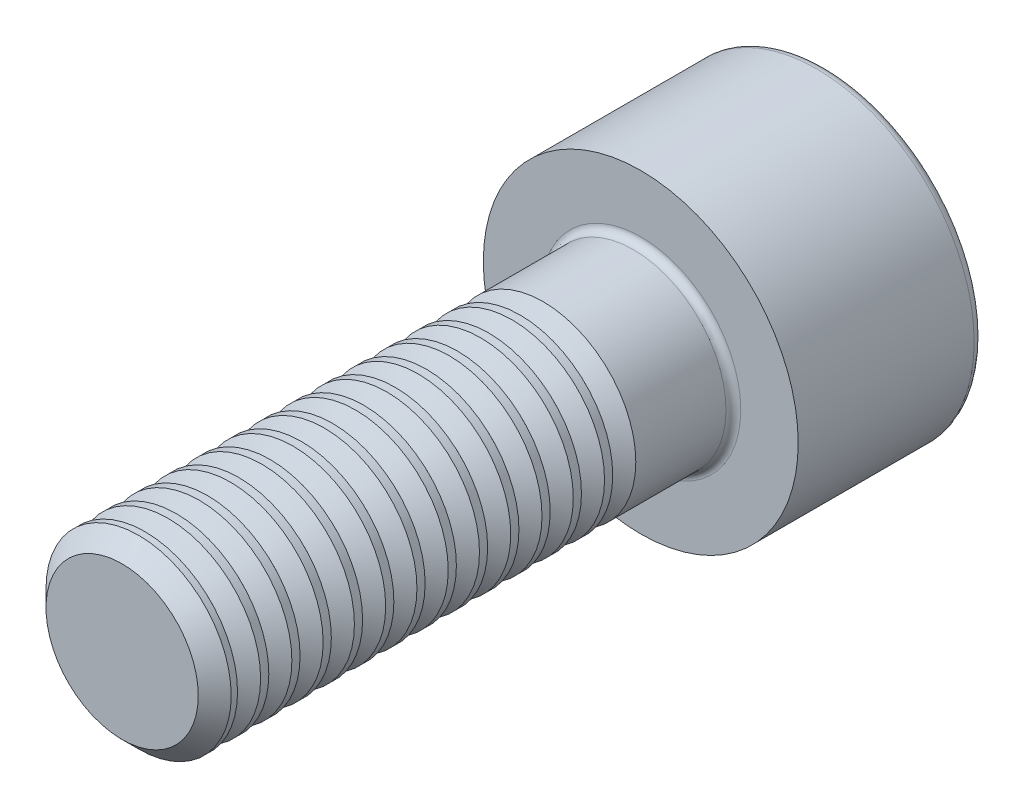
ISO-10303-21;
HEADER;
FILE_DESCRIPTION(('STEP AP214'),'2;1');
FILE_NAME('part.step','',(''),(''),'','','');
FILE_SCHEMA(('AUTOMOTIVE_DESIGN { 1 0 10303 214 1 1 1 1 }'));
ENDSEC;
DATA;
#1=APPLICATION_CONTEXT('core data for automotive mechanical design processes');
#2=APPLICATION_PROTOCOL_DEFINITION('international standard','automotive_design',2000,#1);
#3=PRODUCT_CONTEXT('',#1,'mechanical');
#4=PRODUCT('Part','Part','',(#3));
#5=PRODUCT_RELATED_PRODUCT_CATEGORY('part','',(#4));
#6=PRODUCT_DEFINITION_FORMATION('','',#4);
#7=PRODUCT_DEFINITION_CONTEXT('part definition',#1,'design');
#8=PRODUCT_DEFINITION('design','',#6,#7);
#9=PRODUCT_DEFINITION_SHAPE('','',#8);
#10=(LENGTH_UNIT() NAMED_UNIT(*) SI_UNIT(.MILLI.,.METRE.));
#11=(NAMED_UNIT(*) PLANE_ANGLE_UNIT() SI_UNIT($,.RADIAN.));
#12=(NAMED_UNIT(*) SI_UNIT($,.STERADIAN.) SOLID_ANGLE_UNIT());
#13=UNCERTAINTY_MEASURE_WITH_UNIT(LENGTH_MEASURE(1.E-05),#10,'distance_accuracy_value','');
#14=(GEOMETRIC_REPRESENTATION_CONTEXT(3) GLOBAL_UNCERTAINTY_ASSIGNED_CONTEXT((#13)) GLOBAL_UNIT_ASSIGNED_CONTEXT((#10,
#11,#12)) REPRESENTATION_CONTEXT('',''));
#15=CARTESIAN_POINT('',(0.,0.,0.));
#16=DIRECTION('',(0.,0.,1.));
#17=DIRECTION('',(1.,0.,0.));
#18=AXIS2_PLACEMENT_3D('',#15,#16,#17);
#19=CARTESIAN_POINT('',(0.,0.,19.));
#20=DIRECTION('',(0.,0.,-1.));
#21=DIRECTION('',(-1.,0.,0.));
#22=AXIS2_PLACEMENT_3D('',#19,#20,#21);
#23=CYLINDRICAL_SURFACE('',#22,2.5);
#24=CARTESIAN_POINT('',(0.,0.,17.5407106504117));
#25=DIRECTION('',(0.,0.,-1.));
#26=DIRECTION('',(-1.,0.,0.));
#27=AXIS2_PLACEMENT_3D('',#24,#25,#26);
#28=CIRCLE('',#27,2.5);
#29=CARTESIAN_POINT('',(-2.5,0.,17.5407106504117));
#30=VERTEX_POINT('',#29);
#31=EDGE_CURVE('E274',#30,#30,#28,.T.);
#32=ORIENTED_EDGE('',*,*,#31,.F.);
#33=EDGE_LOOP('',(#32));
#34=FACE_BOUND('',#33,.T.);
#35=CARTESIAN_POINT('',(0.,0.,17.7615259414051));
#36=DIRECTION('',(0.,0.,-1.));
#37=DIRECTION('',(-1.,0.,0.));
#38=AXIS2_PLACEMENT_3D('',#35,#36,#37);
#39=CIRCLE('',#38,2.5);
#40=CARTESIAN_POINT('',(-2.5,0.,17.7615259414051));
#41=VERTEX_POINT('',#40);
#42=EDGE_CURVE('E268',#41,#41,#39,.T.);
#43=ORIENTED_EDGE('',*,*,#42,.T.);
#44=EDGE_LOOP('',(#43));
#45=FACE_BOUND('',#44,.T.);
#46=ADVANCED_FACE('F38',(#34,#45),#23,.T.);
#47=CARTESIAN_POINT('',(0.,0.,16.6967106504117));
#48=DIRECTION('',(0.,0.,-1.));
#49=DIRECTION('',(-1.,0.,0.));
#50=AXIS2_PLACEMENT_3D('',#47,#48,#49);
#51=CIRCLE('',#50,2.5);
#52=CARTESIAN_POINT('',(-2.5,0.,16.6967106504117));
#53=VERTEX_POINT('',#52);
#54=EDGE_CURVE('E283',#53,#53,#51,.T.);
#55=ORIENTED_EDGE('',*,*,#54,.F.);
#56=EDGE_LOOP('',(#55));
#57=FACE_BOUND('',#56,.T.);
#58=CARTESIAN_POINT('',(0.,0.,16.9175259414051));
#59=DIRECTION('',(0.,0.,-1.));
#60=DIRECTION('',(-1.,0.,0.));
#61=AXIS2_PLACEMENT_3D('',#58,#59,#60);
#62=CIRCLE('',#61,2.5);
#63=CARTESIAN_POINT('',(-2.5,0.,16.9175259414051));
#64=VERTEX_POINT('',#63);
#65=EDGE_CURVE('E277',#64,#64,#62,.T.);
#66=ORIENTED_EDGE('',*,*,#65,.T.);
#67=EDGE_LOOP('',(#66));
#68=FACE_BOUND('',#67,.T.);
#69=ADVANCED_FACE('F178',(#57,#68),#23,.T.);
#70=CARTESIAN_POINT('',(0.,0.,15.8527106504117));
#71=DIRECTION('',(0.,0.,-1.));
#72=DIRECTION('',(-1.,0.,0.));
#73=AXIS2_PLACEMENT_3D('',#70,#71,#72);
#74=CIRCLE('',#73,2.5);
#75=CARTESIAN_POINT('',(-2.5,0.,15.8527106504117));
#76=VERTEX_POINT('',#75);
#77=EDGE_CURVE('E292',#76,#76,#74,.T.);
#78=ORIENTED_EDGE('',*,*,#77,.F.);
#79=EDGE_LOOP('',(#78));
#80=FACE_BOUND('',#79,.T.);
#81=CARTESIAN_POINT('',(0.,0.,16.0735259414051));
#82=DIRECTION('',(0.,0.,-1.));
#83=DIRECTION('',(-1.,0.,0.));
#84=AXIS2_PLACEMENT_3D('',#81,#82,#83);
#85=CIRCLE('',#84,2.5);
#86=CARTESIAN_POINT('',(-2.5,0.,16.0735259414051));
#87=VERTEX_POINT('',#86);
#88=EDGE_CURVE('E286',#87,#87,#85,.T.);
#89=ORIENTED_EDGE('',*,*,#88,.T.);
#90=EDGE_LOOP('',(#89));
#91=FACE_BOUND('',#90,.T.);
#92=ADVANCED_FACE('F188',(#80,#91),#23,.T.);
#93=CARTESIAN_POINT('',(0.,0.,15.0087106504117));
#94=DIRECTION('',(0.,0.,-1.));
#95=DIRECTION('',(-1.,0.,0.));
#96=AXIS2_PLACEMENT_3D('',#93,#94,#95);
#97=CIRCLE('',#96,2.5);
#98=CARTESIAN_POINT('',(-2.5,0.,15.0087106504117));
#99=VERTEX_POINT('',#98);
#100=EDGE_CURVE('E301',#99,#99,#97,.T.);
#101=ORIENTED_EDGE('',*,*,#100,.F.);
#102=EDGE_LOOP('',(#101));
#103=FACE_BOUND('',#102,.T.);
#104=CARTESIAN_POINT('',(0.,0.,15.2295259414051));
#105=DIRECTION('',(0.,0.,-1.));
#106=DIRECTION('',(-1.,0.,0.));
#107=AXIS2_PLACEMENT_3D('',#104,#105,#106);
#108=CIRCLE('',#107,2.5);
#109=CARTESIAN_POINT('',(-2.5,0.,15.2295259414051));
#110=VERTEX_POINT('',#109);
#111=EDGE_CURVE('E295',#110,#110,#108,.T.);
#112=ORIENTED_EDGE('',*,*,#111,.T.);
#113=EDGE_LOOP('',(#112));
#114=FACE_BOUND('',#113,.T.);
#115=ADVANCED_FACE('F596',(#103,#114),#23,.T.);
#116=CARTESIAN_POINT('',(0.,0.,14.1647106504117));
#117=DIRECTION('',(0.,0.,-1.));
#118=DIRECTION('',(-1.,0.,0.));
#119=AXIS2_PLACEMENT_3D('',#116,#117,#118);
#120=CIRCLE('',#119,2.5);
#121=CARTESIAN_POINT('',(-2.5,0.,14.1647106504117));
#122=VERTEX_POINT('',#121);
#123=EDGE_CURVE('E310',#122,#122,#120,.T.);
#124=ORIENTED_EDGE('',*,*,#123,.F.);
#125=EDGE_LOOP('',(#124));
#126=FACE_BOUND('',#125,.T.);
#127=CARTESIAN_POINT('',(0.,0.,14.3855259414051));
#128=DIRECTION('',(0.,0.,-1.));
#129=DIRECTION('',(-1.,0.,0.));
#130=AXIS2_PLACEMENT_3D('',#127,#128,#129);
#131=CIRCLE('',#130,2.5);
#132=CARTESIAN_POINT('',(-2.5,0.,14.3855259414051));
#133=VERTEX_POINT('',#132);
#134=EDGE_CURVE('E304',#133,#133,#131,.T.);
#135=ORIENTED_EDGE('',*,*,#134,.T.);
#136=EDGE_LOOP('',(#135));
#137=FACE_BOUND('',#136,.T.);
#138=ADVANCED_FACE('F588',(#126,#137),#23,.T.);
#139=CARTESIAN_POINT('',(0.,0.,13.3207106504117));
#140=DIRECTION('',(0.,0.,-1.));
#141=DIRECTION('',(-1.,0.,0.));
#142=AXIS2_PLACEMENT_3D('',#139,#140,#141);
#143=CIRCLE('',#142,2.5);
#144=CARTESIAN_POINT('',(-2.5,0.,13.3207106504117));
#145=VERTEX_POINT('',#144);
#146=EDGE_CURVE('E319',#145,#145,#143,.T.);
#147=ORIENTED_EDGE('',*,*,#146,.F.);
#148=EDGE_LOOP('',(#147));
#149=FACE_BOUND('',#148,.T.);
#150=CARTESIAN_POINT('',(0.,0.,13.5415259414051));
#151=DIRECTION('',(0.,0.,-1.));
#152=DIRECTION('',(-1.,0.,0.));
#153=AXIS2_PLACEMENT_3D('',#150,#151,#152);
#154=CIRCLE('',#153,2.5);
#155=CARTESIAN_POINT('',(-2.5,0.,13.5415259414051));
#156=VERTEX_POINT('',#155);
#157=EDGE_CURVE('E313',#156,#156,#154,.T.);
#158=ORIENTED_EDGE('',*,*,#157,.T.);
#159=EDGE_LOOP('',(#158));
#160=FACE_BOUND('',#159,.T.);
#161=ADVANCED_FACE('F580',(#149,#160),#23,.T.);
#162=CARTESIAN_POINT('',(0.,0.,12.4767106504117));
#163=DIRECTION('',(0.,0.,-1.));
#164=DIRECTION('',(-1.,0.,0.));
#165=AXIS2_PLACEMENT_3D('',#162,#163,#164);
#166=CIRCLE('',#165,2.5);
#167=CARTESIAN_POINT('',(-2.5,0.,12.4767106504117));
#168=VERTEX_POINT('',#167);
#169=EDGE_CURVE('E328',#168,#168,#166,.T.);
#170=ORIENTED_EDGE('',*,*,#169,.F.);
#171=EDGE_LOOP('',(#170));
#172=FACE_BOUND('',#171,.T.);
#173=CARTESIAN_POINT('',(0.,0.,12.6975259414051));
#174=DIRECTION('',(0.,0.,-1.));
#175=DIRECTION('',(-1.,0.,0.));
#176=AXIS2_PLACEMENT_3D('',#173,#174,#175);
#177=CIRCLE('',#176,2.5);
#178=CARTESIAN_POINT('',(-2.5,0.,12.6975259414051));
#179=VERTEX_POINT('',#178);
#180=EDGE_CURVE('E322',#179,#179,#177,.T.);
#181=ORIENTED_EDGE('',*,*,#180,.T.);
#182=EDGE_LOOP('',(#181));
#183=FACE_BOUND('',#182,.T.);
#184=ADVANCED_FACE('F572',(#172,#183),#23,.T.);
#185=CARTESIAN_POINT('',(0.,0.,11.6327106504117));
#186=DIRECTION('',(0.,0.,-1.));
#187=DIRECTION('',(-1.,0.,0.));
#188=AXIS2_PLACEMENT_3D('',#185,#186,#187);
#189=CIRCLE('',#188,2.5);
#190=CARTESIAN_POINT('',(-2.5,0.,11.6327106504117));
#191=VERTEX_POINT('',#190);
#192=EDGE_CURVE('E337',#191,#191,#189,.T.);
#193=ORIENTED_EDGE('',*,*,#192,.F.);
#194=EDGE_LOOP('',(#193));
#195=FACE_BOUND('',#194,.T.);
#196=CARTESIAN_POINT('',(0.,0.,11.8535259414051));
#197=DIRECTION('',(0.,0.,-1.));
#198=DIRECTION('',(-1.,0.,0.));
#199=AXIS2_PLACEMENT_3D('',#196,#197,#198);
#200=CIRCLE('',#199,2.5);
#201=CARTESIAN_POINT('',(-2.5,0.,11.8535259414051));
#202=VERTEX_POINT('',#201);
#203=EDGE_CURVE('E331',#202,#202,#200,.T.);
#204=ORIENTED_EDGE('',*,*,#203,.T.);
#205=EDGE_LOOP('',(#204));
#206=FACE_BOUND('',#205,.T.);
#207=ADVANCED_FACE('F564',(#195,#206),#23,.T.);
#208=CARTESIAN_POINT('',(0.,0.,10.7887106504117));
#209=DIRECTION('',(0.,0.,-1.));
#210=DIRECTION('',(-1.,0.,0.));
#211=AXIS2_PLACEMENT_3D('',#208,#209,#210);
#212=CIRCLE('',#211,2.5);
#213=CARTESIAN_POINT('',(-2.5,0.,10.7887106504117));
#214=VERTEX_POINT('',#213);
#215=EDGE_CURVE('E346',#214,#214,#212,.T.);
#216=ORIENTED_EDGE('',*,*,#215,.F.);
#217=EDGE_LOOP('',(#216));
#218=FACE_BOUND('',#217,.T.);
#219=CARTESIAN_POINT('',(0.,0.,11.0095259414051));
#220=DIRECTION('',(0.,0.,-1.));
#221=DIRECTION('',(-1.,0.,0.));
#222=AXIS2_PLACEMENT_3D('',#219,#220,#221);
#223=CIRCLE('',#222,2.5);
#224=CARTESIAN_POINT('',(-2.5,0.,11.0095259414051));
#225=VERTEX_POINT('',#224);
#226=EDGE_CURVE('E340',#225,#225,#223,.T.);
#227=ORIENTED_EDGE('',*,*,#226,.T.);
#228=EDGE_LOOP('',(#227));
#229=FACE_BOUND('',#228,.T.);
#230=ADVANCED_FACE('F556',(#218,#229),#23,.T.);
#231=CARTESIAN_POINT('',(0.,0.,9.94471065041172));
#232=DIRECTION('',(0.,0.,-1.));
#233=DIRECTION('',(-1.,0.,0.));
#234=AXIS2_PLACEMENT_3D('',#231,#232,#233);
#235=CIRCLE('',#234,2.5);
#236=CARTESIAN_POINT('',(-2.5,0.,9.94471065041172));
#237=VERTEX_POINT('',#236);
#238=EDGE_CURVE('E355',#237,#237,#235,.T.);
#239=ORIENTED_EDGE('',*,*,#238,.F.);
#240=EDGE_LOOP('',(#239));
#241=FACE_BOUND('',#240,.T.);
#242=CARTESIAN_POINT('',(0.,0.,10.1655259414051));
#243=DIRECTION('',(0.,0.,-1.));
#244=DIRECTION('',(-1.,0.,0.));
#245=AXIS2_PLACEMENT_3D('',#242,#243,#244);
#246=CIRCLE('',#245,2.5);
#247=CARTESIAN_POINT('',(-2.5,0.,10.1655259414051));
#248=VERTEX_POINT('',#247);
#249=EDGE_CURVE('E349',#248,#248,#246,.T.);
#250=ORIENTED_EDGE('',*,*,#249,.T.);
#251=EDGE_LOOP('',(#250));
#252=FACE_BOUND('',#251,.T.);
#253=ADVANCED_FACE('F548',(#241,#252),#23,.T.);
#254=CARTESIAN_POINT('',(0.,0.,9.10071065041172));
#255=DIRECTION('',(0.,0.,-1.));
#256=DIRECTION('',(-1.,0.,0.));
#257=AXIS2_PLACEMENT_3D('',#254,#255,#256);
#258=CIRCLE('',#257,2.5);
#259=CARTESIAN_POINT('',(-2.5,0.,9.10071065041172));
#260=VERTEX_POINT('',#259);
#261=EDGE_CURVE('E364',#260,#260,#258,.T.);
#262=ORIENTED_EDGE('',*,*,#261,.F.);
#263=EDGE_LOOP('',(#262));
#264=FACE_BOUND('',#263,.T.);
#265=CARTESIAN_POINT('',(0.,0.,9.32152594140508));
#266=DIRECTION('',(0.,0.,-1.));
#267=DIRECTION('',(-1.,0.,0.));
#268=AXIS2_PLACEMENT_3D('',#265,#266,#267);
#269=CIRCLE('',#268,2.5);
#270=CARTESIAN_POINT('',(-2.5,0.,9.32152594140508));
#271=VERTEX_POINT('',#270);
#272=EDGE_CURVE('E358',#271,#271,#269,.T.);
#273=ORIENTED_EDGE('',*,*,#272,.T.);
#274=EDGE_LOOP('',(#273));
#275=FACE_BOUND('',#274,.T.);
#276=ADVANCED_FACE('F204',(#264,#275),#23,.T.);
#277=CARTESIAN_POINT('',(0.,0.,8.25671065041172));
#278=DIRECTION('',(0.,0.,-1.));
#279=DIRECTION('',(-1.,0.,0.));
#280=AXIS2_PLACEMENT_3D('',#277,#278,#279);
#281=CIRCLE('',#280,2.5);
#282=CARTESIAN_POINT('',(-2.5,0.,8.25671065041172));
#283=VERTEX_POINT('',#282);
#284=EDGE_CURVE('E211',#283,#283,#281,.T.);
#285=ORIENTED_EDGE('',*,*,#284,.F.);
#286=EDGE_LOOP('',(#285));
#287=FACE_BOUND('',#286,.T.);
#288=CARTESIAN_POINT('',(0.,0.,8.47752594140508));
#289=DIRECTION('',(0.,0.,-1.));
#290=DIRECTION('',(-1.,0.,0.));
#291=AXIS2_PLACEMENT_3D('',#288,#289,#290);
#292=CIRCLE('',#291,2.5);
#293=CARTESIAN_POINT('',(-2.5,0.,8.47752594140508));
#294=VERTEX_POINT('',#293);
#295=EDGE_CURVE('E367',#294,#294,#292,.T.);
#296=ORIENTED_EDGE('',*,*,#295,.T.);
#297=EDGE_LOOP('',(#296));
#298=FACE_BOUND('',#297,.T.);
#299=ADVANCED_FACE('F195',(#287,#298),#23,.T.);
#300=CARTESIAN_POINT('',(0.,0.,5.2));
#301=DIRECTION('',(0.,0.,1.));
#302=DIRECTION('',(1.,0.,0.));
#303=AXIS2_PLACEMENT_3D('',#300,#301,#302);
#304=CIRCLE('',#303,2.5);
#305=CARTESIAN_POINT('',(2.5,0.,5.2));
#306=VERTEX_POINT('',#305);
#307=EDGE_CURVE('E158',#306,#306,#304,.T.);
#308=ORIENTED_EDGE('',*,*,#307,.T.);
#309=EDGE_LOOP('',(#308));
#310=FACE_BOUND('',#309,.T.);
#311=CARTESIAN_POINT('',(0.,0.,7.63352594140508));
#312=DIRECTION('',(0.,0.,-1.));
#313=DIRECTION('',(-1.,0.,0.));
#314=AXIS2_PLACEMENT_3D('',#311,#312,#313);
#315=CIRCLE('',#314,2.5);
#316=CARTESIAN_POINT('',(-2.5,0.,7.63352594140508));
#317=VERTEX_POINT('',#316);
#318=EDGE_CURVE('E131',#317,#317,#315,.T.);
#319=ORIENTED_EDGE('',*,*,#318,.T.);
#320=EDGE_LOOP('',(#319));
#321=FACE_BOUND('',#320,.T.);
#322=ADVANCED_FACE('F184',(#310,#321),#23,.T.);
#323=CARTESIAN_POINT('',(0.,0.,5.));
#324=DIRECTION('',(0.,0.,-1.));
#325=DIRECTION('',(-1.,0.,0.));
#326=AXIS2_PLACEMENT_3D('',#323,#324,#325);
#327=CYLINDRICAL_SURFACE('',#326,4.25);
#328=CARTESIAN_POINT('',(0.,0.,0.25));
#329=DIRECTION('',(0.,0.,1.));
#330=DIRECTION('',(1.,0.,0.));
#331=AXIS2_PLACEMENT_3D('',#328,#329,#330);
#332=CIRCLE('',#331,4.25);
#333=CARTESIAN_POINT('',(4.25,0.,0.25));
#334=VERTEX_POINT('',#333);
#335=EDGE_CURVE('E152',#334,#334,#332,.T.);
#336=ORIENTED_EDGE('',*,*,#335,.T.);
#337=EDGE_LOOP('',(#336));
#338=FACE_BOUND('',#337,.T.);
#339=CARTESIAN_POINT('',(0.,0.,5.));
#340=DIRECTION('',(0.,0.,1.));
#341=DIRECTION('',(1.,0.,0.));
#342=AXIS2_PLACEMENT_3D('',#339,#340,#341);
#343=CIRCLE('',#342,4.25);
#344=CARTESIAN_POINT('',(4.25,0.,5.));
#345=VERTEX_POINT('',#344);
#346=EDGE_CURVE('E144',#345,#345,#343,.T.);
#347=ORIENTED_EDGE('',*,*,#346,.F.);
#348=EDGE_LOOP('',(#347));
#349=FACE_BOUND('',#348,.T.);
#350=ADVANCED_FACE('F194',(#338,#349),#327,.T.);
#351=CARTESIAN_POINT('',(0.,0.,5.));
#352=DIRECTION('',(0.,0.,1.));
#353=DIRECTION('',(1.,0.,0.));
#354=AXIS2_PLACEMENT_3D('',#351,#352,#353);
#355=PLANE('',#354);
#356=CARTESIAN_POINT('',(0.,0.,5.));
#357=DIRECTION('',(0.,0.,1.));
#358=DIRECTION('',(1.,0.,0.));
#359=AXIS2_PLACEMENT_3D('',#356,#357,#358);
#360=CIRCLE('',#359,2.7);
#361=CARTESIAN_POINT('',(2.7,0.,5.));
#362=VERTEX_POINT('',#361);
#363=EDGE_CURVE('E161',#362,#362,#360,.F.);
#364=ORIENTED_EDGE('',*,*,#363,.T.);
#365=EDGE_LOOP('',(#364));
#366=FACE_BOUND('',#365,.T.);
#367=ORIENTED_EDGE('',*,*,#346,.T.);
#368=EDGE_LOOP('',(#367));
#369=FACE_BOUND('',#368,.T.);
#370=ADVANCED_FACE('F201',(#366,#369),#355,.T.);
#371=CARTESIAN_POINT('',(0.,0.,0.));
#372=DIRECTION('',(0.,0.,1.));
#373=DIRECTION('',(1.,0.,0.));
#374=AXIS2_PLACEMENT_3D('',#371,#372,#373);
#375=PLANE('',#374);
#376=CARTESIAN_POINT('',(0.,0.,0.));
#377=DIRECTION('',(0.,0.,1.));
#378=DIRECTION('',(1.,0.,0.));
#379=AXIS2_PLACEMENT_3D('',#376,#377,#378);
#380=CIRCLE('',#379,4.);
#381=CARTESIAN_POINT('',(4.,0.,0.));
#382=VERTEX_POINT('',#381);
#383=EDGE_CURVE('E155',#382,#382,#380,.F.);
#384=ORIENTED_EDGE('',*,*,#383,.T.);
#385=EDGE_LOOP('',(#384));
#386=FACE_BOUND('',#385,.T.);
#387=DIRECTION('',(0.866025403784438,-0.5,0.));
#388=VECTOR('',#387,1.);
#389=CARTESIAN_POINT('',(0.,2.358,0.));
#390=LINE('',#389,#388);
#391=CARTESIAN_POINT('',(0.,2.358,0.));
#392=VERTEX_POINT('',#391);
#393=CARTESIAN_POINT('',(2.04208790212371,1.179,0.));
#394=VERTEX_POINT('',#393);
#395=EDGE_CURVE('E130',#392,#394,#390,.T.);
#396=ORIENTED_EDGE('',*,*,#395,.F.);
#397=DIRECTION('',(0.866025403784439,0.5,0.));
#398=VECTOR('',#397,1.);
#399=CARTESIAN_POINT('',(-2.04208790212371,1.179,0.));
#400=LINE('',#399,#398);
#401=CARTESIAN_POINT('',(-2.04208790212371,1.179,0.));
#402=VERTEX_POINT('',#401);
#403=EDGE_CURVE('E54',#402,#392,#400,.T.);
#404=ORIENTED_EDGE('',*,*,#403,.F.);
#405=DIRECTION('',(0.,1.,0.));
#406=VECTOR('',#405,1.);
#407=CARTESIAN_POINT('',(-2.04208790212371,-1.179,0.));
#408=LINE('',#407,#406);
#409=CARTESIAN_POINT('',(-2.04208790212371,-1.179,0.));
#410=VERTEX_POINT('',#409);
#411=EDGE_CURVE('E140',#410,#402,#408,.T.);
#412=ORIENTED_EDGE('',*,*,#411,.F.);
#413=DIRECTION('',(-0.866025403784439,0.5,0.));
#414=VECTOR('',#413,1.);
#415=CARTESIAN_POINT('',(0.,-2.358,0.));
#416=LINE('',#415,#414);
#417=CARTESIAN_POINT('',(0.,-2.358,0.));
#418=VERTEX_POINT('',#417);
#419=EDGE_CURVE('E138',#418,#410,#416,.T.);
#420=ORIENTED_EDGE('',*,*,#419,.F.);
#421=DIRECTION('',(-0.866025403784439,-0.5,0.));
#422=VECTOR('',#421,1.);
#423=CARTESIAN_POINT('',(2.04208790212371,-1.179,0.));
#424=LINE('',#423,#422);
#425=CARTESIAN_POINT('',(2.04208790212371,-1.179,0.));
#426=VERTEX_POINT('',#425);
#427=EDGE_CURVE('E104',#426,#418,#424,.T.);
#428=ORIENTED_EDGE('',*,*,#427,.F.);
#429=DIRECTION('',(0.,-1.,0.));
#430=VECTOR('',#429,1.);
#431=CARTESIAN_POINT('',(2.04208790212371,1.179,0.));
#432=LINE('',#431,#430);
#433=EDGE_CURVE('E134',#394,#426,#432,.T.);
#434=ORIENTED_EDGE('',*,*,#433,.F.);
#435=EDGE_LOOP('',(#396,#404,#412,#420,#428,#434));
#436=FACE_BOUND('',#435,.T.);
#437=ADVANCED_FACE('F225',(#386,#436),#375,.F.);
#438=CARTESIAN_POINT('',(-2.04208790212371,1.179,2.5));
#439=DIRECTION('',(-0.5,0.866025403784439,0.));
#440=DIRECTION('',(-0.866025403784439,-0.5,0.));
#441=AXIS2_PLACEMENT_3D('',#438,#439,#440);
#442=PLANE('',#441);
#443=ORIENTED_EDGE('',*,*,#403,.T.);
#444=DIRECTION('',(0.,0.,-1.));
#445=VECTOR('',#444,1.);
#446=CARTESIAN_POINT('',(0.,2.358,2.5));
#447=LINE('',#446,#445);
#448=CARTESIAN_POINT('',(0.,2.358,2.5));
#449=VERTEX_POINT('',#448);
#450=EDGE_CURVE('E85',#449,#392,#447,.T.);
#451=ORIENTED_EDGE('',*,*,#450,.F.);
#452=DIRECTION('',(0.866025403784439,0.5,0.));
#453=VECTOR('',#452,1.);
#454=CARTESIAN_POINT('',(-2.04208790212371,1.179,2.5));
#455=LINE('',#454,#453);
#456=CARTESIAN_POINT('',(-2.04208790212371,1.179,2.5));
#457=VERTEX_POINT('',#456);
#458=EDGE_CURVE('E142',#457,#449,#455,.T.);
#459=ORIENTED_EDGE('',*,*,#458,.F.);
#460=DIRECTION('',(0.,0.,-1.));
#461=VECTOR('',#460,1.);
#462=CARTESIAN_POINT('',(-2.04208790212371,1.179,2.5));
#463=LINE('',#462,#461);
#464=EDGE_CURVE('E62',#457,#402,#463,.T.);
#465=ORIENTED_EDGE('',*,*,#464,.T.);
#466=EDGE_LOOP('',(#443,#451,#459,#465));
#467=FACE_BOUND('',#466,.T.);
#468=ADVANCED_FACE('F229',(#467),#442,.F.);
#469=CARTESIAN_POINT('',(-2.04208790212371,-1.179,2.5));
#470=DIRECTION('',(-1.,0.,0.));
#471=DIRECTION('',(0.,-1.,0.));
#472=AXIS2_PLACEMENT_3D('',#469,#470,#471);
#473=PLANE('',#472);
#474=ORIENTED_EDGE('',*,*,#411,.T.);
#475=ORIENTED_EDGE('',*,*,#464,.F.);
#476=DIRECTION('',(0.,1.,0.));
#477=VECTOR('',#476,1.);
#478=CARTESIAN_POINT('',(-2.04208790212371,-1.179,2.5));
#479=LINE('',#478,#477);
#480=CARTESIAN_POINT('',(-2.04208790212371,-1.179,2.5));
#481=VERTEX_POINT('',#480);
#482=EDGE_CURVE('E116',#481,#457,#479,.T.);
#483=ORIENTED_EDGE('',*,*,#482,.F.);
#484=DIRECTION('',(0.,0.,-1.));
#485=VECTOR('',#484,1.);
#486=CARTESIAN_POINT('',(-2.04208790212371,-1.179,2.5));
#487=LINE('',#486,#485);
#488=EDGE_CURVE('E108',#481,#410,#487,.T.);
#489=ORIENTED_EDGE('',*,*,#488,.T.);
#490=EDGE_LOOP('',(#474,#475,#483,#489));
#491=FACE_BOUND('',#490,.T.);
#492=ADVANCED_FACE('F227',(#491),#473,.F.);
#493=CARTESIAN_POINT('',(0.,-2.358,2.5));
#494=DIRECTION('',(-0.5,-0.866025403784439,0.));
#495=DIRECTION('',(0.866025403784439,-0.5,0.));
#496=AXIS2_PLACEMENT_3D('',#493,#494,#495);
#497=PLANE('',#496);
#498=ORIENTED_EDGE('',*,*,#419,.T.);
#499=ORIENTED_EDGE('',*,*,#488,.F.);
#500=DIRECTION('',(-0.866025403784439,0.5,0.));
#501=VECTOR('',#500,1.);
#502=CARTESIAN_POINT('',(0.,-2.358,2.5));
#503=LINE('',#502,#501);
#504=CARTESIAN_POINT('',(0.,-2.358,2.5));
#505=VERTEX_POINT('',#504);
#506=EDGE_CURVE('E112',#505,#481,#503,.T.);
#507=ORIENTED_EDGE('',*,*,#506,.F.);
#508=DIRECTION('',(0.,0.,-1.));
#509=VECTOR('',#508,1.);
#510=CARTESIAN_POINT('',(0.,-2.358,2.5));
#511=LINE('',#510,#509);
#512=EDGE_CURVE('E97',#505,#418,#511,.T.);
#513=ORIENTED_EDGE('',*,*,#512,.T.);
#514=EDGE_LOOP('',(#498,#499,#507,#513));
#515=FACE_BOUND('',#514,.T.);
#516=ADVANCED_FACE('F113',(#515),#497,.F.);
#517=CARTESIAN_POINT('',(2.04208790212371,-1.179,2.5));
#518=DIRECTION('',(0.5,-0.866025403784439,0.));
#519=DIRECTION('',(0.866025403784439,0.5,0.));
#520=AXIS2_PLACEMENT_3D('',#517,#518,#519);
#521=PLANE('',#520);
#522=ORIENTED_EDGE('',*,*,#427,.T.);
#523=ORIENTED_EDGE('',*,*,#512,.F.);
#524=DIRECTION('',(-0.866025403784439,-0.5,0.));
#525=VECTOR('',#524,1.);
#526=CARTESIAN_POINT('',(2.04208790212371,-1.179,2.5));
#527=LINE('',#526,#525);
#528=CARTESIAN_POINT('',(2.04208790212371,-1.179,2.5));
#529=VERTEX_POINT('',#528);
#530=EDGE_CURVE('E101',#529,#505,#527,.T.);
#531=ORIENTED_EDGE('',*,*,#530,.F.);
#532=DIRECTION('',(0.,0.,-1.));
#533=VECTOR('',#532,1.);
#534=CARTESIAN_POINT('',(2.04208790212371,-1.179,2.5));
#535=LINE('',#534,#533);
#536=EDGE_CURVE('E109',#529,#426,#535,.T.);
#537=ORIENTED_EDGE('',*,*,#536,.T.);
#538=EDGE_LOOP('',(#522,#523,#531,#537));
#539=FACE_BOUND('',#538,.T.);
#540=ADVANCED_FACE('F99',(#539),#521,.F.);
#541=CARTESIAN_POINT('',(2.04208790212371,1.179,2.5));
#542=DIRECTION('',(1.,0.,0.));
#543=DIRECTION('',(0.,1.,0.));
#544=AXIS2_PLACEMENT_3D('',#541,#542,#543);
#545=PLANE('',#544);
#546=ORIENTED_EDGE('',*,*,#433,.T.);
#547=ORIENTED_EDGE('',*,*,#536,.F.);
#548=DIRECTION('',(0.,-1.,0.));
#549=VECTOR('',#548,1.);
#550=CARTESIAN_POINT('',(2.04208790212371,1.179,2.5));
#551=LINE('',#550,#549);
#552=CARTESIAN_POINT('',(2.04208790212371,1.179,2.5));
#553=VERTEX_POINT('',#552);
#554=EDGE_CURVE('E122',#553,#529,#551,.T.);
#555=ORIENTED_EDGE('',*,*,#554,.F.);
#556=DIRECTION('',(0.,0.,-1.));
#557=VECTOR('',#556,1.);
#558=CARTESIAN_POINT('',(2.04208790212371,1.179,2.5));
#559=LINE('',#558,#557);
#560=EDGE_CURVE('E147',#553,#394,#559,.T.);
#561=ORIENTED_EDGE('',*,*,#560,.T.);
#562=EDGE_LOOP('',(#546,#547,#555,#561));
#563=FACE_BOUND('',#562,.T.);
#564=ADVANCED_FACE('F223',(#563),#545,.F.);
#565=CARTESIAN_POINT('',(0.,2.358,2.5));
#566=DIRECTION('',(0.5,0.866025403784438,0.));
#567=DIRECTION('',(-0.866025403784439,0.5,0.));
#568=AXIS2_PLACEMENT_3D('',#565,#566,#567);
#569=PLANE('',#568);
#570=ORIENTED_EDGE('',*,*,#395,.T.);
#571=ORIENTED_EDGE('',*,*,#560,.F.);
#572=DIRECTION('',(0.866025403784438,-0.5,0.));
#573=VECTOR('',#572,1.);
#574=CARTESIAN_POINT('',(0.,2.358,2.5));
#575=LINE('',#574,#573);
#576=EDGE_CURVE('E124',#449,#553,#575,.T.);
#577=ORIENTED_EDGE('',*,*,#576,.F.);
#578=ORIENTED_EDGE('',*,*,#450,.T.);
#579=EDGE_LOOP('',(#570,#571,#577,#578));
#580=FACE_BOUND('',#579,.T.);
#581=ADVANCED_FACE('F219',(#580),#569,.F.);
#582=CARTESIAN_POINT('',(0.,0.,2.5));
#583=DIRECTION('',(0.,0.,-1.));
#584=DIRECTION('',(-1.,0.,0.));
#585=AXIS2_PLACEMENT_3D('',#582,#583,#584);
#586=PLANE('',#585);
#587=CARTESIAN_POINT('',(0.,0.,2.5));
#588=DIRECTION('',(0.,0.,1.));
#589=DIRECTION('',(1.,0.,0.));
#590=AXIS2_PLACEMENT_3D('',#587,#588,#589);
#591=CIRCLE('',#590,2.04199999999998);
#592=CARTESIAN_POINT('',(2.04199999999998,0.,2.5));
#593=VERTEX_POINT('',#592);
#594=EDGE_CURVE('E258',#593,#593,#591,.T.);
#595=ORIENTED_EDGE('',*,*,#594,.T.);
#596=EDGE_LOOP('',(#595));
#597=FACE_BOUND('',#596,.T.);
#598=ORIENTED_EDGE('',*,*,#458,.T.);
#599=ORIENTED_EDGE('',*,*,#576,.T.);
#600=ORIENTED_EDGE('',*,*,#554,.T.);
#601=ORIENTED_EDGE('',*,*,#530,.T.);
#602=ORIENTED_EDGE('',*,*,#506,.T.);
#603=ORIENTED_EDGE('',*,*,#482,.T.);
#604=EDGE_LOOP('',(#598,#599,#600,#601,#602,#603));
#605=FACE_BOUND('',#604,.T.);
#606=ADVANCED_FACE('F119',(#597,#605),#586,.T.);
#607=CARTESIAN_POINT('',(0.,0.,0.25));
#608=DIRECTION('',(0.,0.,1.));
#609=DIRECTION('',(1.,0.,0.));
#610=AXIS2_PLACEMENT_3D('',#607,#608,#609);
#611=TOROIDAL_SURFACE('',#610,4.,0.25);
#612=ORIENTED_EDGE('',*,*,#383,.F.);
#613=EDGE_LOOP('',(#612));
#614=FACE_BOUND('',#613,.T.);
#615=ORIENTED_EDGE('',*,*,#335,.F.);
#616=EDGE_LOOP('',(#615));
#617=FACE_BOUND('',#616,.T.);
#618=ADVANCED_FACE('F248',(#614,#617),#611,.T.);
#619=CARTESIAN_POINT('',(0.,0.,5.2));
#620=DIRECTION('',(0.,0.,1.));
#621=DIRECTION('',(1.,0.,0.));
#622=AXIS2_PLACEMENT_3D('',#619,#620,#621);
#623=TOROIDAL_SURFACE('',#622,2.7,0.2);
#624=ORIENTED_EDGE('',*,*,#363,.F.);
#625=EDGE_LOOP('',(#624));
#626=FACE_BOUND('',#625,.T.);
#627=ORIENTED_EDGE('',*,*,#307,.F.);
#628=EDGE_LOOP('',(#627));
#629=FACE_BOUND('',#628,.T.);
#630=ADVANCED_FACE('F253',(#626,#629),#623,.F.);
#631=CARTESIAN_POINT('',(0.,0.,7.63352594140508));
#632=DIRECTION('',(0.,0.,-1.));
#633=DIRECTION('',(-1.,0.,0.));
#634=AXIS2_PLACEMENT_3D('',#631,#632,#633);
#635=CONICAL_SURFACE('',#634,2.5,0.959931088596891);
#636=CARTESIAN_POINT('',(0.,0.,7.9451182959084));
#637=DIRECTION('',(0.,0.,-1.));
#638=DIRECTION('',(-1.,0.,0.));
#639=AXIS2_PLACEMENT_3D('',#636,#637,#638);
#640=CIRCLE('',#639,2.05499999999999);
#641=CARTESIAN_POINT('',(-2.05499999999999,0.,7.9451182959084));
#642=VERTEX_POINT('',#641);
#643=EDGE_CURVE('E214',#642,#642,#640,.T.);
#644=ORIENTED_EDGE('',*,*,#643,.T.);
#645=EDGE_LOOP('',(#644));
#646=FACE_BOUND('',#645,.T.);
#647=ORIENTED_EDGE('',*,*,#318,.F.);
#648=EDGE_LOOP('',(#647));
#649=FACE_BOUND('',#648,.T.);
#650=ADVANCED_FACE('F372',(#646,#649),#635,.T.);
#651=CARTESIAN_POINT('',(0.,0.,7.9451182959084));
#652=DIRECTION('',(0.,0.,1.));
#653=DIRECTION('',(1.,0.,0.));
#654=AXIS2_PLACEMENT_3D('',#651,#652,#653);
#655=CONICAL_SURFACE('',#654,2.05499999999999,0.95993108859688);
#656=ORIENTED_EDGE('',*,*,#284,.T.);
#657=EDGE_LOOP('',(#656));
#658=FACE_BOUND('',#657,.T.);
#659=ORIENTED_EDGE('',*,*,#643,.F.);
#660=EDGE_LOOP('',(#659));
#661=FACE_BOUND('',#660,.T.);
#662=ADVANCED_FACE('F374',(#658,#661),#655,.T.);
#663=CARTESIAN_POINT('',(0.,0.,8.47752594140508));
#664=DIRECTION('',(0.,0.,-1.));
#665=DIRECTION('',(-1.,0.,0.));
#666=AXIS2_PLACEMENT_3D('',#663,#664,#665);
#667=CONICAL_SURFACE('',#666,2.5,0.959931088596891);
#668=CARTESIAN_POINT('',(0.,0.,8.78911829590839));
#669=DIRECTION('',(0.,0.,-1.));
#670=DIRECTION('',(-1.,0.,0.));
#671=AXIS2_PLACEMENT_3D('',#668,#669,#670);
#672=CIRCLE('',#671,2.05499999999999);
#673=CARTESIAN_POINT('',(-2.05499999999999,0.,8.78911829590839));
#674=VERTEX_POINT('',#673);
#675=EDGE_CURVE('E361',#674,#674,#672,.T.);
#676=ORIENTED_EDGE('',*,*,#675,.T.);
#677=EDGE_LOOP('',(#676));
#678=FACE_BOUND('',#677,.T.);
#679=ORIENTED_EDGE('',*,*,#295,.F.);
#680=EDGE_LOOP('',(#679));
#681=FACE_BOUND('',#680,.T.);
#682=ADVANCED_FACE('F376',(#678,#681),#667,.T.);
#683=CARTESIAN_POINT('',(0.,0.,8.78911829590839));
#684=DIRECTION('',(0.,0.,1.));
#685=DIRECTION('',(1.,0.,0.));
#686=AXIS2_PLACEMENT_3D('',#683,#684,#685);
#687=CONICAL_SURFACE('',#686,2.05499999999999,0.95993108859688);
#688=ORIENTED_EDGE('',*,*,#261,.T.);
#689=EDGE_LOOP('',(#688));
#690=FACE_BOUND('',#689,.T.);
#691=ORIENTED_EDGE('',*,*,#675,.F.);
#692=EDGE_LOOP('',(#691));
#693=FACE_BOUND('',#692,.T.);
#694=ADVANCED_FACE('F383',(#690,#693),#687,.T.);
#695=CARTESIAN_POINT('',(0.,0.,9.32152594140508));
#696=DIRECTION('',(0.,0.,-1.));
#697=DIRECTION('',(-1.,0.,0.));
#698=AXIS2_PLACEMENT_3D('',#695,#696,#697);
#699=CONICAL_SURFACE('',#698,2.5,0.959931088596891);
#700=CARTESIAN_POINT('',(0.,0.,9.6331182959084));
#701=DIRECTION('',(0.,0.,-1.));
#702=DIRECTION('',(-1.,0.,0.));
#703=AXIS2_PLACEMENT_3D('',#700,#701,#702);
#704=CIRCLE('',#703,2.05499999999999);
#705=CARTESIAN_POINT('',(-2.05499999999999,0.,9.6331182959084));
#706=VERTEX_POINT('',#705);
#707=EDGE_CURVE('E352',#706,#706,#704,.T.);
#708=ORIENTED_EDGE('',*,*,#707,.T.);
#709=EDGE_LOOP('',(#708));
#710=FACE_BOUND('',#709,.T.);
#711=ORIENTED_EDGE('',*,*,#272,.F.);
#712=EDGE_LOOP('',(#711));
#713=FACE_BOUND('',#712,.T.);
#714=ADVANCED_FACE('F389',(#710,#713),#699,.T.);
#715=CARTESIAN_POINT('',(0.,0.,9.6331182959084));
#716=DIRECTION('',(0.,0.,1.));
#717=DIRECTION('',(1.,0.,0.));
#718=AXIS2_PLACEMENT_3D('',#715,#716,#717);
#719=CONICAL_SURFACE('',#718,2.05499999999999,0.95993108859688);
#720=ORIENTED_EDGE('',*,*,#238,.T.);
#721=EDGE_LOOP('',(#720));
#722=FACE_BOUND('',#721,.T.);
#723=ORIENTED_EDGE('',*,*,#707,.F.);
#724=EDGE_LOOP('',(#723));
#725=FACE_BOUND('',#724,.T.);
#726=ADVANCED_FACE('F393',(#722,#725),#719,.T.);
#727=CARTESIAN_POINT('',(0.,0.,10.1655259414051));
#728=DIRECTION('',(0.,0.,-1.));
#729=DIRECTION('',(-1.,0.,0.));
#730=AXIS2_PLACEMENT_3D('',#727,#728,#729);
#731=CONICAL_SURFACE('',#730,2.5,0.959931088596891);
#732=CARTESIAN_POINT('',(0.,0.,10.4771182959084));
#733=DIRECTION('',(0.,0.,-1.));
#734=DIRECTION('',(-1.,0.,0.));
#735=AXIS2_PLACEMENT_3D('',#732,#733,#734);
#736=CIRCLE('',#735,2.05499999999999);
#737=CARTESIAN_POINT('',(-2.05499999999999,0.,10.4771182959084));
#738=VERTEX_POINT('',#737);
#739=EDGE_CURVE('E343',#738,#738,#736,.T.);
#740=ORIENTED_EDGE('',*,*,#739,.T.);
#741=EDGE_LOOP('',(#740));
#742=FACE_BOUND('',#741,.T.);
#743=ORIENTED_EDGE('',*,*,#249,.F.);
#744=EDGE_LOOP('',(#743));
#745=FACE_BOUND('',#744,.T.);
#746=ADVANCED_FACE('F397',(#742,#745),#731,.T.);
#747=CARTESIAN_POINT('',(0.,0.,10.4771182959084));
#748=DIRECTION('',(0.,0.,1.));
#749=DIRECTION('',(1.,0.,0.));
#750=AXIS2_PLACEMENT_3D('',#747,#748,#749);
#751=CONICAL_SURFACE('',#750,2.05499999999999,0.95993108859688);
#752=ORIENTED_EDGE('',*,*,#215,.T.);
#753=EDGE_LOOP('',(#752));
#754=FACE_BOUND('',#753,.T.);
#755=ORIENTED_EDGE('',*,*,#739,.F.);
#756=EDGE_LOOP('',(#755));
#757=FACE_BOUND('',#756,.T.);
#758=ADVANCED_FACE('F401',(#754,#757),#751,.T.);
#759=CARTESIAN_POINT('',(0.,0.,11.0095259414051));
#760=DIRECTION('',(0.,0.,-1.));
#761=DIRECTION('',(-1.,0.,0.));
#762=AXIS2_PLACEMENT_3D('',#759,#760,#761);
#763=CONICAL_SURFACE('',#762,2.5,0.959931088596891);
#764=CARTESIAN_POINT('',(0.,0.,11.3211182959084));
#765=DIRECTION('',(0.,0.,-1.));
#766=DIRECTION('',(-1.,0.,0.));
#767=AXIS2_PLACEMENT_3D('',#764,#765,#766);
#768=CIRCLE('',#767,2.05499999999999);
#769=CARTESIAN_POINT('',(-2.05499999999999,0.,11.3211182959084));
#770=VERTEX_POINT('',#769);
#771=EDGE_CURVE('E334',#770,#770,#768,.T.);
#772=ORIENTED_EDGE('',*,*,#771,.T.);
#773=EDGE_LOOP('',(#772));
#774=FACE_BOUND('',#773,.T.);
#775=ORIENTED_EDGE('',*,*,#226,.F.);
#776=EDGE_LOOP('',(#775));
#777=FACE_BOUND('',#776,.T.);
#778=ADVANCED_FACE('F405',(#774,#777),#763,.T.);
#779=CARTESIAN_POINT('',(0.,0.,11.3211182959084));
#780=DIRECTION('',(0.,0.,1.));
#781=DIRECTION('',(1.,0.,0.));
#782=AXIS2_PLACEMENT_3D('',#779,#780,#781);
#783=CONICAL_SURFACE('',#782,2.05499999999999,0.95993108859688);
#784=ORIENTED_EDGE('',*,*,#192,.T.);
#785=EDGE_LOOP('',(#784));
#786=FACE_BOUND('',#785,.T.);
#787=ORIENTED_EDGE('',*,*,#771,.F.);
#788=EDGE_LOOP('',(#787));
#789=FACE_BOUND('',#788,.T.);
#790=ADVANCED_FACE('F409',(#786,#789),#783,.T.);
#791=CARTESIAN_POINT('',(0.,0.,11.8535259414051));
#792=DIRECTION('',(0.,0.,-1.));
#793=DIRECTION('',(-1.,0.,0.));
#794=AXIS2_PLACEMENT_3D('',#791,#792,#793);
#795=CONICAL_SURFACE('',#794,2.5,0.959931088596891);
#796=CARTESIAN_POINT('',(0.,0.,12.1651182959084));
#797=DIRECTION('',(0.,0.,-1.));
#798=DIRECTION('',(-1.,0.,0.));
#799=AXIS2_PLACEMENT_3D('',#796,#797,#798);
#800=CIRCLE('',#799,2.05499999999999);
#801=CARTESIAN_POINT('',(-2.05499999999999,0.,12.1651182959084));
#802=VERTEX_POINT('',#801);
#803=EDGE_CURVE('E325',#802,#802,#800,.T.);
#804=ORIENTED_EDGE('',*,*,#803,.T.);
#805=EDGE_LOOP('',(#804));
#806=FACE_BOUND('',#805,.T.);
#807=ORIENTED_EDGE('',*,*,#203,.F.);
#808=EDGE_LOOP('',(#807));
#809=FACE_BOUND('',#808,.T.);
#810=ADVANCED_FACE('F413',(#806,#809),#795,.T.);
#811=CARTESIAN_POINT('',(0.,0.,12.1651182959084));
#812=DIRECTION('',(0.,0.,1.));
#813=DIRECTION('',(1.,0.,0.));
#814=AXIS2_PLACEMENT_3D('',#811,#812,#813);
#815=CONICAL_SURFACE('',#814,2.05499999999999,0.95993108859688);
#816=ORIENTED_EDGE('',*,*,#169,.T.);
#817=EDGE_LOOP('',(#816));
#818=FACE_BOUND('',#817,.T.);
#819=ORIENTED_EDGE('',*,*,#803,.F.);
#820=EDGE_LOOP('',(#819));
#821=FACE_BOUND('',#820,.T.);
#822=ADVANCED_FACE('F417',(#818,#821),#815,.T.);
#823=CARTESIAN_POINT('',(0.,0.,12.6975259414051));
#824=DIRECTION('',(0.,0.,-1.));
#825=DIRECTION('',(-1.,0.,0.));
#826=AXIS2_PLACEMENT_3D('',#823,#824,#825);
#827=CONICAL_SURFACE('',#826,2.5,0.959931088596891);
#828=CARTESIAN_POINT('',(0.,0.,13.0091182959084));
#829=DIRECTION('',(0.,0.,-1.));
#830=DIRECTION('',(-1.,0.,0.));
#831=AXIS2_PLACEMENT_3D('',#828,#829,#830);
#832=CIRCLE('',#831,2.05499999999999);
#833=CARTESIAN_POINT('',(-2.05499999999999,0.,13.0091182959084));
#834=VERTEX_POINT('',#833);
#835=EDGE_CURVE('E316',#834,#834,#832,.T.);
#836=ORIENTED_EDGE('',*,*,#835,.T.);
#837=EDGE_LOOP('',(#836));
#838=FACE_BOUND('',#837,.T.);
#839=ORIENTED_EDGE('',*,*,#180,.F.);
#840=EDGE_LOOP('',(#839));
#841=FACE_BOUND('',#840,.T.);
#842=ADVANCED_FACE('F421',(#838,#841),#827,.T.);
#843=CARTESIAN_POINT('',(0.,0.,13.0091182959084));
#844=DIRECTION('',(0.,0.,1.));
#845=DIRECTION('',(1.,0.,0.));
#846=AXIS2_PLACEMENT_3D('',#843,#844,#845);
#847=CONICAL_SURFACE('',#846,2.05499999999999,0.95993108859688);
#848=ORIENTED_EDGE('',*,*,#146,.T.);
#849=EDGE_LOOP('',(#848));
#850=FACE_BOUND('',#849,.T.);
#851=ORIENTED_EDGE('',*,*,#835,.F.);
#852=EDGE_LOOP('',(#851));
#853=FACE_BOUND('',#852,.T.);
#854=ADVANCED_FACE('F425',(#850,#853),#847,.T.);
#855=CARTESIAN_POINT('',(0.,0.,13.5415259414051));
#856=DIRECTION('',(0.,0.,-1.));
#857=DIRECTION('',(-1.,0.,0.));
#858=AXIS2_PLACEMENT_3D('',#855,#856,#857);
#859=CONICAL_SURFACE('',#858,2.5,0.959931088596891);
#860=CARTESIAN_POINT('',(0.,0.,13.8531182959084));
#861=DIRECTION('',(0.,0.,-1.));
#862=DIRECTION('',(-1.,0.,0.));
#863=AXIS2_PLACEMENT_3D('',#860,#861,#862);
#864=CIRCLE('',#863,2.05499999999999);
#865=CARTESIAN_POINT('',(-2.05499999999999,0.,13.8531182959084));
#866=VERTEX_POINT('',#865);
#867=EDGE_CURVE('E307',#866,#866,#864,.T.);
#868=ORIENTED_EDGE('',*,*,#867,.T.);
#869=EDGE_LOOP('',(#868));
#870=FACE_BOUND('',#869,.T.);
#871=ORIENTED_EDGE('',*,*,#157,.F.);
#872=EDGE_LOOP('',(#871));
#873=FACE_BOUND('',#872,.T.);
#874=ADVANCED_FACE('F429',(#870,#873),#859,.T.);
#875=CARTESIAN_POINT('',(0.,0.,13.8531182959084));
#876=DIRECTION('',(0.,0.,1.));
#877=DIRECTION('',(1.,0.,0.));
#878=AXIS2_PLACEMENT_3D('',#875,#876,#877);
#879=CONICAL_SURFACE('',#878,2.05499999999999,0.95993108859688);
#880=ORIENTED_EDGE('',*,*,#123,.T.);
#881=EDGE_LOOP('',(#880));
#882=FACE_BOUND('',#881,.T.);
#883=ORIENTED_EDGE('',*,*,#867,.F.);
#884=EDGE_LOOP('',(#883));
#885=FACE_BOUND('',#884,.T.);
#886=ADVANCED_FACE('F433',(#882,#885),#879,.T.);
#887=CARTESIAN_POINT('',(0.,0.,14.3855259414051));
#888=DIRECTION('',(0.,0.,-1.));
#889=DIRECTION('',(-1.,0.,0.));
#890=AXIS2_PLACEMENT_3D('',#887,#888,#889);
#891=CONICAL_SURFACE('',#890,2.5,0.959931088596891);
#892=CARTESIAN_POINT('',(0.,0.,14.6971182959084));
#893=DIRECTION('',(0.,0.,-1.));
#894=DIRECTION('',(-1.,0.,0.));
#895=AXIS2_PLACEMENT_3D('',#892,#893,#894);
#896=CIRCLE('',#895,2.05499999999999);
#897=CARTESIAN_POINT('',(-2.05499999999999,0.,14.6971182959084));
#898=VERTEX_POINT('',#897);
#899=EDGE_CURVE('E298',#898,#898,#896,.T.);
#900=ORIENTED_EDGE('',*,*,#899,.T.);
#901=EDGE_LOOP('',(#900));
#902=FACE_BOUND('',#901,.T.);
#903=ORIENTED_EDGE('',*,*,#134,.F.);
#904=EDGE_LOOP('',(#903));
#905=FACE_BOUND('',#904,.T.);
#906=ADVANCED_FACE('F437',(#902,#905),#891,.T.);
#907=CARTESIAN_POINT('',(0.,0.,14.6971182959084));
#908=DIRECTION('',(0.,0.,1.));
#909=DIRECTION('',(1.,0.,0.));
#910=AXIS2_PLACEMENT_3D('',#907,#908,#909);
#911=CONICAL_SURFACE('',#910,2.05499999999999,0.95993108859688);
#912=ORIENTED_EDGE('',*,*,#100,.T.);
#913=EDGE_LOOP('',(#912));
#914=FACE_BOUND('',#913,.T.);
#915=ORIENTED_EDGE('',*,*,#899,.F.);
#916=EDGE_LOOP('',(#915));
#917=FACE_BOUND('',#916,.T.);
#918=ADVANCED_FACE('F441',(#914,#917),#911,.T.);
#919=CARTESIAN_POINT('',(0.,0.,15.2295259414051));
#920=DIRECTION('',(0.,0.,-1.));
#921=DIRECTION('',(-1.,0.,0.));
#922=AXIS2_PLACEMENT_3D('',#919,#920,#921);
#923=CONICAL_SURFACE('',#922,2.5,0.959931088596891);
#924=CARTESIAN_POINT('',(0.,0.,15.5411182959084));
#925=DIRECTION('',(0.,0.,-1.));
#926=DIRECTION('',(-1.,0.,0.));
#927=AXIS2_PLACEMENT_3D('',#924,#925,#926);
#928=CIRCLE('',#927,2.05499999999999);
#929=CARTESIAN_POINT('',(-2.05499999999999,0.,15.5411182959084));
#930=VERTEX_POINT('',#929);
#931=EDGE_CURVE('E289',#930,#930,#928,.T.);
#932=ORIENTED_EDGE('',*,*,#931,.T.);
#933=EDGE_LOOP('',(#932));
#934=FACE_BOUND('',#933,.T.);
#935=ORIENTED_EDGE('',*,*,#111,.F.);
#936=EDGE_LOOP('',(#935));
#937=FACE_BOUND('',#936,.T.);
#938=ADVANCED_FACE('F445',(#934,#937),#923,.T.);
#939=CARTESIAN_POINT('',(0.,0.,15.5411182959084));
#940=DIRECTION('',(0.,0.,1.));
#941=DIRECTION('',(1.,0.,0.));
#942=AXIS2_PLACEMENT_3D('',#939,#940,#941);
#943=CONICAL_SURFACE('',#942,2.05499999999999,0.95993108859688);
#944=ORIENTED_EDGE('',*,*,#77,.T.);
#945=EDGE_LOOP('',(#944));
#946=FACE_BOUND('',#945,.T.);
#947=ORIENTED_EDGE('',*,*,#931,.F.);
#948=EDGE_LOOP('',(#947));
#949=FACE_BOUND('',#948,.T.);
#950=ADVANCED_FACE('F449',(#946,#949),#943,.T.);
#951=CARTESIAN_POINT('',(0.,0.,16.0735259414051));
#952=DIRECTION('',(0.,0.,-1.));
#953=DIRECTION('',(-1.,0.,0.));
#954=AXIS2_PLACEMENT_3D('',#951,#952,#953);
#955=CONICAL_SURFACE('',#954,2.5,0.959931088596891);
#956=CARTESIAN_POINT('',(0.,0.,16.3851182959084));
#957=DIRECTION('',(0.,0.,-1.));
#958=DIRECTION('',(-1.,0.,0.));
#959=AXIS2_PLACEMENT_3D('',#956,#957,#958);
#960=CIRCLE('',#959,2.05499999999999);
#961=CARTESIAN_POINT('',(-2.05499999999999,0.,16.3851182959084));
#962=VERTEX_POINT('',#961);
#963=EDGE_CURVE('E280',#962,#962,#960,.T.);
#964=ORIENTED_EDGE('',*,*,#963,.T.);
#965=EDGE_LOOP('',(#964));
#966=FACE_BOUND('',#965,.T.);
#967=ORIENTED_EDGE('',*,*,#88,.F.);
#968=EDGE_LOOP('',(#967));
#969=FACE_BOUND('',#968,.T.);
#970=ADVANCED_FACE('F453',(#966,#969),#955,.T.);
#971=CARTESIAN_POINT('',(0.,0.,16.3851182959084));
#972=DIRECTION('',(0.,0.,1.));
#973=DIRECTION('',(1.,0.,0.));
#974=AXIS2_PLACEMENT_3D('',#971,#972,#973);
#975=CONICAL_SURFACE('',#974,2.05499999999999,0.95993108859688);
#976=ORIENTED_EDGE('',*,*,#54,.T.);
#977=EDGE_LOOP('',(#976));
#978=FACE_BOUND('',#977,.T.);
#979=ORIENTED_EDGE('',*,*,#963,.F.);
#980=EDGE_LOOP('',(#979));
#981=FACE_BOUND('',#980,.T.);
#982=ADVANCED_FACE('F457',(#978,#981),#975,.T.);
#983=CARTESIAN_POINT('',(0.,0.,16.9175259414051));
#984=DIRECTION('',(0.,0.,-1.));
#985=DIRECTION('',(-1.,0.,0.));
#986=AXIS2_PLACEMENT_3D('',#983,#984,#985);
#987=CONICAL_SURFACE('',#986,2.5,0.959931088596891);
#988=CARTESIAN_POINT('',(0.,0.,17.2291182959084));
#989=DIRECTION('',(0.,0.,-1.));
#990=DIRECTION('',(-1.,0.,0.));
#991=AXIS2_PLACEMENT_3D('',#988,#989,#990);
#992=CIRCLE('',#991,2.05499999999999);
#993=CARTESIAN_POINT('',(-2.05499999999999,0.,17.2291182959084));
#994=VERTEX_POINT('',#993);
#995=EDGE_CURVE('E271',#994,#994,#992,.T.);
#996=ORIENTED_EDGE('',*,*,#995,.T.);
#997=EDGE_LOOP('',(#996));
#998=FACE_BOUND('',#997,.T.);
#999=ORIENTED_EDGE('',*,*,#65,.F.);
#1000=EDGE_LOOP('',(#999));
#1001=FACE_BOUND('',#1000,.T.);
#1002=ADVANCED_FACE('F461',(#998,#1001),#987,.T.);
#1003=CARTESIAN_POINT('',(0.,0.,17.2291182959084));
#1004=DIRECTION('',(0.,0.,1.));
#1005=DIRECTION('',(1.,0.,0.));
#1006=AXIS2_PLACEMENT_3D('',#1003,#1004,#1005);
#1007=CONICAL_SURFACE('',#1006,2.05499999999999,0.95993108859688);
#1008=ORIENTED_EDGE('',*,*,#31,.T.);
#1009=EDGE_LOOP('',(#1008));
#1010=FACE_BOUND('',#1009,.T.);
#1011=ORIENTED_EDGE('',*,*,#995,.F.);
#1012=EDGE_LOOP('',(#1011));
#1013=FACE_BOUND('',#1012,.T.);
#1014=ADVANCED_FACE('F465',(#1010,#1013),#1007,.T.);
#1015=CARTESIAN_POINT('',(0.,0.,17.7615259414051));
#1016=DIRECTION('',(0.,0.,-1.));
#1017=DIRECTION('',(-1.,0.,0.));
#1018=AXIS2_PLACEMENT_3D('',#1015,#1016,#1017);
#1019=CONICAL_SURFACE('',#1018,2.5,0.959931088596891);
#1020=CARTESIAN_POINT('',(0.,0.,18.0731182959084));
#1021=DIRECTION('',(0.,0.,-1.));
#1022=DIRECTION('',(-1.,0.,0.));
#1023=AXIS2_PLACEMENT_3D('',#1020,#1021,#1022);
#1024=CIRCLE('',#1023,2.05499999999999);
#1025=CARTESIAN_POINT('',(-2.05499999999999,0.,18.0731182959084));
#1026=VERTEX_POINT('',#1025);
#1027=EDGE_CURVE('E260',#1026,#1026,#1024,.T.);
#1028=ORIENTED_EDGE('',*,*,#1027,.T.);
#1029=EDGE_LOOP('',(#1028));
#1030=FACE_BOUND('',#1029,.T.);
#1031=ORIENTED_EDGE('',*,*,#42,.F.);
#1032=EDGE_LOOP('',(#1031));
#1033=FACE_BOUND('',#1032,.T.);
#1034=ADVANCED_FACE('F469',(#1030,#1033),#1019,.T.);
#1035=CARTESIAN_POINT('',(0.,0.,18.0731182959084));
#1036=DIRECTION('',(0.,0.,1.));
#1037=DIRECTION('',(1.,0.,0.));
#1038=AXIS2_PLACEMENT_3D('',#1035,#1036,#1037);
#1039=CONICAL_SURFACE('',#1038,2.05499999999999,0.95993108859688);
#1040=CARTESIAN_POINT('',(0.,0.,18.3847106504117));
#1041=DIRECTION('',(0.,0.,-1.));
#1042=DIRECTION('',(-1.,0.,0.));
#1043=AXIS2_PLACEMENT_3D('',#1040,#1041,#1042);
#1044=CIRCLE('',#1043,2.5);
#1045=CARTESIAN_POINT('',(-2.5,0.,18.3847106504117));
#1046=VERTEX_POINT('',#1045);
#1047=EDGE_CURVE('E263',#1046,#1046,#1044,.T.);
#1048=ORIENTED_EDGE('',*,*,#1047,.T.);
#1049=EDGE_LOOP('',(#1048));
#1050=FACE_BOUND('',#1049,.T.);
#1051=ORIENTED_EDGE('',*,*,#1027,.F.);
#1052=EDGE_LOOP('',(#1051));
#1053=FACE_BOUND('',#1052,.T.);
#1054=ADVANCED_FACE('F179',(#1050,#1053),#1039,.T.);
#1055=CARTESIAN_POINT('',(0.,0.,19.));
#1056=DIRECTION('',(0.,0.,1.));
#1057=DIRECTION('',(1.,0.,0.));
#1058=AXIS2_PLACEMENT_3D('',#1055,#1056,#1057);
#1059=PLANE('',#1058);
#1060=CARTESIAN_POINT('',(0.,0.,19.));
#1061=DIRECTION('',(0.,0.,1.));
#1062=DIRECTION('',(1.,0.,0.));
#1063=AXIS2_PLACEMENT_3D('',#1060,#1061,#1062);
#1064=CIRCLE('',#1063,2.055);
#1065=CARTESIAN_POINT('',(2.055,0.,19.));
#1066=VERTEX_POINT('',#1065);
#1067=EDGE_CURVE('E47',#1066,#1066,#1064,.T.);
#1068=ORIENTED_EDGE('',*,*,#1067,.T.);
#1069=EDGE_LOOP('',(#1068));
#1070=FACE_BOUND('',#1069,.T.);
#1071=ADVANCED_FACE('F166',(#1070),#1059,.T.);
#1072=CARTESIAN_POINT('',(0.,0.,19.));
#1073=DIRECTION('',(0.,0.,-1.));
#1074=DIRECTION('',(-1.,0.,0.));
#1075=AXIS2_PLACEMENT_3D('',#1072,#1073,#1074);
#1076=CONICAL_SURFACE('',#1075,2.055,0.785398163397442);
#1077=CARTESIAN_POINT('',(0.,0.,18.555));
#1078=DIRECTION('',(0.,0.,1.));
#1079=DIRECTION('',(1.,0.,0.));
#1080=AXIS2_PLACEMENT_3D('',#1077,#1078,#1079);
#1081=CIRCLE('',#1080,2.5);
#1082=CARTESIAN_POINT('',(2.5,0.,18.555));
#1083=VERTEX_POINT('',#1082);
#1084=EDGE_CURVE('E11',#1083,#1083,#1081,.F.);
#1085=ORIENTED_EDGE('',*,*,#1084,.F.);
#1086=EDGE_LOOP('',(#1085));
#1087=FACE_BOUND('',#1086,.T.);
#1088=ORIENTED_EDGE('',*,*,#1067,.F.);
#1089=EDGE_LOOP('',(#1088));
#1090=FACE_BOUND('',#1089,.T.);
#1091=ADVANCED_FACE('F41',(#1087,#1090),#1076,.T.);
#1092=ORIENTED_EDGE('',*,*,#1084,.T.);
#1093=EDGE_LOOP('',(#1092));
#1094=FACE_BOUND('',#1093,.T.);
#1095=ORIENTED_EDGE('',*,*,#1047,.F.);
#1096=EDGE_LOOP('',(#1095));
#1097=FACE_BOUND('',#1096,.T.);
#1098=ADVANCED_FACE('F169',(#1094,#1097),#23,.T.);
#1099=CARTESIAN_POINT('',(0.,0.,3.6789492496852));
#1100=DIRECTION('',(0.,0.,-1.));
#1101=DIRECTION('',(-1.,0.,0.));
#1102=AXIS2_PLACEMENT_3D('',#1099,#1100,#1101);
#1103=CONICAL_SURFACE('',#1102,0.,1.0471975511966);
#1104=ORIENTED_EDGE('',*,*,#594,.F.);
#1105=EDGE_LOOP('',(#1104));
#1106=FACE_BOUND('',#1105,.T.);
#1107=CARTESIAN_POINT('',(0.,0.,3.6789492496852));
#1108=VERTEX_POINT('',#1107);
#1109=VERTEX_LOOP('',#1108);
#1110=FACE_BOUND('',#1109,.T.);
#1111=ADVANCED_FACE('F175',(#1106,#1110),#1103,.F.);
#1112=CLOSED_SHELL('',(#46,#69,#92,#115,#138,#161,#184,#207,#230,#253,#276,#299,#322,#350,#370,
#437,#468,#492,#516,#540,#564,#581,#606,#618,#630,#650,#662,#682,#694,#714,#726,#746,#758,#778,
#790,#810,#822,#842,#854,#874,#886,#906,#918,#938,#950,#970,#982,#1002,#1014,#1034,#1054,#1071,
#1091,#1098,#1111));
#1113=MANIFOLD_SOLID_BREP('B2',#1112);
#1114=ADVANCED_BREP_SHAPE_REPRESENTATION('',(#18,#1113),#14);
#1115=SHAPE_DEFINITION_REPRESENTATION(#9,#1114);
ENDSEC;
END-ISO-10303-21;
